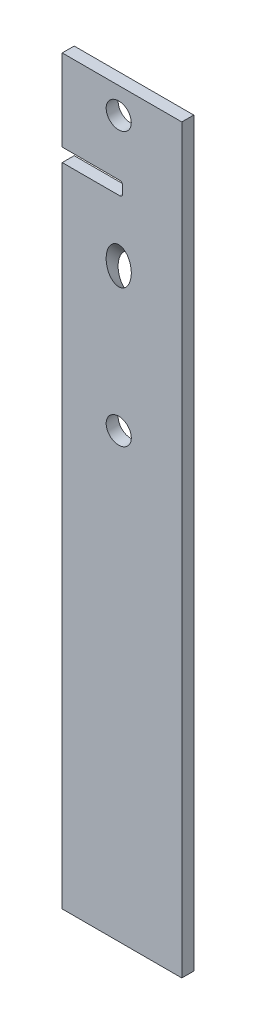
ISO-10303-21;
HEADER;
FILE_DESCRIPTION(('STEP AP214'),'2;1');
FILE_NAME('part.step','',(''),(''),'','','');
FILE_SCHEMA(('AUTOMOTIVE_DESIGN { 1 0 10303 214 1 1 1 1 }'));
ENDSEC;
DATA;
#1=APPLICATION_CONTEXT('core data for automotive mechanical design processes');
#2=APPLICATION_PROTOCOL_DEFINITION('international standard','automotive_design',2000,#1);
#3=PRODUCT_CONTEXT('',#1,'mechanical');
#4=PRODUCT('Part','Part','',(#3));
#5=PRODUCT_RELATED_PRODUCT_CATEGORY('part','',(#4));
#6=PRODUCT_DEFINITION_FORMATION('','',#4);
#7=PRODUCT_DEFINITION_CONTEXT('part definition',#1,'design');
#8=PRODUCT_DEFINITION('design','',#6,#7);
#9=PRODUCT_DEFINITION_SHAPE('','',#8);
#10=(LENGTH_UNIT() NAMED_UNIT(*) SI_UNIT(.MILLI.,.METRE.));
#11=(NAMED_UNIT(*) PLANE_ANGLE_UNIT() SI_UNIT($,.RADIAN.));
#12=(NAMED_UNIT(*) SI_UNIT($,.STERADIAN.) SOLID_ANGLE_UNIT());
#13=UNCERTAINTY_MEASURE_WITH_UNIT(LENGTH_MEASURE(1.E-05),#10,'distance_accuracy_value','');
#14=(GEOMETRIC_REPRESENTATION_CONTEXT(3) GLOBAL_UNCERTAINTY_ASSIGNED_CONTEXT((#13)) GLOBAL_UNIT_ASSIGNED_CONTEXT((#10,
#11,#12)) REPRESENTATION_CONTEXT('',''));
#15=CARTESIAN_POINT('',(0.,0.,0.));
#16=DIRECTION('',(0.,0.,1.));
#17=DIRECTION('',(1.,0.,0.));
#18=AXIS2_PLACEMENT_3D('',#15,#16,#17);
#19=CARTESIAN_POINT('',(2540.,317.5,-143.842086105115));
#20=DIRECTION('',(1.,0.,0.));
#21=DIRECTION('',(0.,0.,-1.));
#22=AXIS2_PLACEMENT_3D('',#19,#20,#21);
#23=PLANE('',#22);
#24=DIRECTION('',(0.,0.,1.));
#25=VECTOR('',#24,1.);
#26=CARTESIAN_POINT('',(2540.,216.638,-143.842086105115));
#27=LINE('',#26,#25);
#28=CARTESIAN_POINT('',(2540.,216.638,-143.842086105115));
#29=VERTEX_POINT('',#28);
#30=CARTESIAN_POINT('',(2540.,216.638,-131.142086105115));
#31=VERTEX_POINT('',#30);
#32=EDGE_CURVE('E167',#29,#31,#27,.T.);
#33=ORIENTED_EDGE('',*,*,#32,.F.);
#34=DIRECTION('',(0.,-1.,0.));
#35=VECTOR('',#34,1.);
#36=CARTESIAN_POINT('',(2540.,317.5,-143.842086105115));
#37=LINE('',#36,#35);
#38=CARTESIAN_POINT('',(2540.,-469.9,-143.842086105115));
#39=VERTEX_POINT('',#38);
#40=EDGE_CURVE('E248',#29,#39,#37,.T.);
#41=ORIENTED_EDGE('',*,*,#40,.T.);
#42=DIRECTION('',(0.,0.,1.));
#43=VECTOR('',#42,1.);
#44=CARTESIAN_POINT('',(2540.,-469.9,-143.842086105115));
#45=LINE('',#44,#43);
#46=CARTESIAN_POINT('',(2540.,-469.9,-131.142086105115));
#47=VERTEX_POINT('',#46);
#48=EDGE_CURVE('E165',#39,#47,#45,.T.);
#49=ORIENTED_EDGE('',*,*,#48,.T.);
#50=DIRECTION('',(0.,-1.,0.));
#51=VECTOR('',#50,1.);
#52=CARTESIAN_POINT('',(2540.,317.5,-131.142086105115));
#53=LINE('',#52,#51);
#54=EDGE_CURVE('E152',#31,#47,#53,.T.);
#55=ORIENTED_EDGE('',*,*,#54,.F.);
#56=EDGE_LOOP('',(#33,#41,#49,#55));
#57=FACE_BOUND('',#56,.T.);
#58=ADVANCED_FACE('F44',(#57),#23,.F.);
#59=CARTESIAN_POINT('',(2540.,317.5,-143.842086105115));
#60=VERTEX_POINT('',#59);
#61=CARTESIAN_POINT('',(2540.,230.862,-143.842086105115));
#62=VERTEX_POINT('',#61);
#63=EDGE_CURVE('E255',#60,#62,#37,.T.);
#64=ORIENTED_EDGE('',*,*,#63,.T.);
#65=DIRECTION('',(0.,0.,1.));
#66=VECTOR('',#65,1.);
#67=CARTESIAN_POINT('',(2540.,230.862,-143.842086105115));
#68=LINE('',#67,#66);
#69=CARTESIAN_POINT('',(2540.,230.862,-131.142086105115));
#70=VERTEX_POINT('',#69);
#71=EDGE_CURVE('E149',#62,#70,#68,.T.);
#72=ORIENTED_EDGE('',*,*,#71,.T.);
#73=CARTESIAN_POINT('',(2540.,317.5,-131.142086105115));
#74=VERTEX_POINT('',#73);
#75=EDGE_CURVE('E127',#74,#70,#53,.T.);
#76=ORIENTED_EDGE('',*,*,#75,.F.);
#77=DIRECTION('',(0.,0.,1.));
#78=VECTOR('',#77,1.);
#79=CARTESIAN_POINT('',(2540.,317.5,-143.842086105115));
#80=LINE('',#79,#78);
#81=EDGE_CURVE('E134',#60,#74,#80,.T.);
#82=ORIENTED_EDGE('',*,*,#81,.F.);
#83=EDGE_LOOP('',(#64,#72,#76,#82));
#84=FACE_BOUND('',#83,.T.);
#85=ADVANCED_FACE('F147',(#84),#23,.F.);
#86=CARTESIAN_POINT('',(2540.,317.5,-131.142086105115));
#87=DIRECTION('',(0.,0.,-1.));
#88=DIRECTION('',(-1.,0.,0.));
#89=AXIS2_PLACEMENT_3D('',#86,#87,#88);
#90=PLANE('',#89);
#91=CARTESIAN_POINT('',(2599.99999999996,289.999999999996,-131.142086105115));
#92=DIRECTION('',(0.,0.,-1.));
#93=DIRECTION('',(-1.,0.,0.));
#94=AXIS2_PLACEMENT_3D('',#91,#92,#93);
#95=CIRCLE('',#94,13.3349999999999);
#96=CARTESIAN_POINT('',(2586.66499999996,289.999999999996,-131.142086105115));
#97=VERTEX_POINT('',#96);
#98=EDGE_CURVE('E194',#97,#97,#95,.F.);
#99=ORIENTED_EDGE('',*,*,#98,.F.);
#100=EDGE_LOOP('',(#99));
#101=FACE_BOUND('',#100,.T.);
#102=ORIENTED_EDGE('',*,*,#75,.T.);
#103=DIRECTION('',(1.,0.,0.));
#104=VECTOR('',#103,1.);
#105=CARTESIAN_POINT('',(2540.,230.862,-131.142086105115));
#106=LINE('',#105,#104);
#107=CARTESIAN_POINT('',(2601.087,230.862,-131.142086105115));
#108=VERTEX_POINT('',#107);
#109=EDGE_CURVE('E166',#70,#108,#106,.T.);
#110=ORIENTED_EDGE('',*,*,#109,.T.);
#111=CARTESIAN_POINT('',(2601.087,227.687,-131.142086105115));
#112=DIRECTION('',(0.,0.,-1.));
#113=DIRECTION('',(-1.,0.,0.));
#114=AXIS2_PLACEMENT_3D('',#111,#112,#113);
#115=CIRCLE('',#114,3.175);
#116=CARTESIAN_POINT('',(2604.262,227.687,-131.142086105115));
#117=VERTEX_POINT('',#116);
#118=EDGE_CURVE('E228',#108,#117,#115,.T.);
#119=ORIENTED_EDGE('',*,*,#118,.T.);
#120=DIRECTION('',(0.,1.,0.));
#121=VECTOR('',#120,1.);
#122=CARTESIAN_POINT('',(2604.262,217.4,-131.142086105115));
#123=LINE('',#122,#121);
#124=CARTESIAN_POINT('',(2604.262,219.813,-131.142086105115));
#125=VERTEX_POINT('',#124);
#126=EDGE_CURVE('E179',#125,#117,#123,.T.);
#127=ORIENTED_EDGE('',*,*,#126,.F.);
#128=CARTESIAN_POINT('',(2601.087,219.813,-131.142086105115));
#129=DIRECTION('',(0.,0.,-1.));
#130=DIRECTION('',(-1.,0.,0.));
#131=AXIS2_PLACEMENT_3D('',#128,#129,#130);
#132=CIRCLE('',#131,3.175);
#133=CARTESIAN_POINT('',(2601.087,216.638,-131.142086105115));
#134=VERTEX_POINT('',#133);
#135=EDGE_CURVE('E12',#125,#134,#132,.T.);
#136=ORIENTED_EDGE('',*,*,#135,.T.);
#137=DIRECTION('',(1.,0.,0.));
#138=VECTOR('',#137,1.);
#139=CARTESIAN_POINT('',(2540.,216.638,-131.142086105115));
#140=LINE('',#139,#138);
#141=EDGE_CURVE('E162',#31,#134,#140,.T.);
#142=ORIENTED_EDGE('',*,*,#141,.F.);
#143=ORIENTED_EDGE('',*,*,#54,.T.);
#144=DIRECTION('',(1.,0.,0.));
#145=VECTOR('',#144,1.);
#146=CARTESIAN_POINT('',(2540.,-469.9,-131.142086105115));
#147=LINE('',#146,#145);
#148=CARTESIAN_POINT('',(2667.,-469.9,-131.142086105115));
#149=VERTEX_POINT('',#148);
#150=EDGE_CURVE('E158',#47,#149,#147,.T.);
#151=ORIENTED_EDGE('',*,*,#150,.T.);
#152=DIRECTION('',(0.,-1.,0.));
#153=VECTOR('',#152,1.);
#154=CARTESIAN_POINT('',(2667.,317.5,-131.142086105115));
#155=LINE('',#154,#153);
#156=CARTESIAN_POINT('',(2667.,317.5,-131.142086105115));
#157=VERTEX_POINT('',#156);
#158=EDGE_CURVE('E129',#157,#149,#155,.T.);
#159=ORIENTED_EDGE('',*,*,#158,.F.);
#160=DIRECTION('',(1.,0.,0.));
#161=VECTOR('',#160,1.);
#162=CARTESIAN_POINT('',(2540.,317.5,-131.142086105115));
#163=LINE('',#162,#161);
#164=EDGE_CURVE('E121',#74,#157,#163,.T.);
#165=ORIENTED_EDGE('',*,*,#164,.F.);
#166=EDGE_LOOP('',(#102,#110,#119,#127,#136,#142,#143,#151,#159,#165));
#167=FACE_BOUND('',#166,.T.);
#168=CARTESIAN_POINT('',(2599.99999999996,-1.09407005656713E-12,-131.142086105115));
#169=DIRECTION('',(0.,0.,-1.));
#170=DIRECTION('',(-1.,0.,0.));
#171=AXIS2_PLACEMENT_3D('',#168,#169,#170);
#172=CIRCLE('',#171,13.3349999999999);
#173=CARTESIAN_POINT('',(2586.66499999996,-1.09407005656713E-12,-131.142086105115));
#174=VERTEX_POINT('',#173);
#175=EDGE_CURVE('E202',#174,#174,#172,.F.);
#176=ORIENTED_EDGE('',*,*,#175,.F.);
#177=EDGE_LOOP('',(#176));
#178=FACE_BOUND('',#177,.T.);
#179=CARTESIAN_POINT('',(2599.99999999996,151.704709198241,-131.142086105115));
#180=DIRECTION('',(0.,0.,-1.));
#181=DIRECTION('',(0.,1.,0.));
#182=AXIS2_PLACEMENT_3D('',#179,#180,#181);
#183=ELLIPSE('',#182,19.379687717848,13.3349999999999);
#184=CARTESIAN_POINT('',(2599.99999999996,171.084396916089,-131.142086105115));
#185=VERTEX_POINT('',#184);
#186=EDGE_CURVE('E182',#185,#185,#183,.F.);
#187=ORIENTED_EDGE('',*,*,#186,.F.);
#188=EDGE_LOOP('',(#187));
#189=FACE_BOUND('',#188,.T.);
#190=ADVANCED_FACE('F123',(#101,#167,#178,#189),#90,.F.);
#191=CARTESIAN_POINT('',(2667.,317.5,-143.842086105115));
#192=DIRECTION('',(-1.,0.,0.));
#193=DIRECTION('',(0.,0.,1.));
#194=AXIS2_PLACEMENT_3D('',#191,#192,#193);
#195=PLANE('',#194);
#196=DIRECTION('',(0.,0.,-1.));
#197=VECTOR('',#196,1.);
#198=CARTESIAN_POINT('',(2667.,-469.9,-143.842086105115));
#199=LINE('',#198,#197);
#200=CARTESIAN_POINT('',(2667.,-469.9,-143.842086105115));
#201=VERTEX_POINT('',#200);
#202=EDGE_CURVE('E151',#149,#201,#199,.T.);
#203=ORIENTED_EDGE('',*,*,#202,.T.);
#204=DIRECTION('',(0.,-1.,0.));
#205=VECTOR('',#204,1.);
#206=CARTESIAN_POINT('',(2667.,317.5,-143.842086105115));
#207=LINE('',#206,#205);
#208=CARTESIAN_POINT('',(2667.,317.5,-143.842086105115));
#209=VERTEX_POINT('',#208);
#210=EDGE_CURVE('E144',#209,#201,#207,.T.);
#211=ORIENTED_EDGE('',*,*,#210,.F.);
#212=DIRECTION('',(0.,0.,-1.));
#213=VECTOR('',#212,1.);
#214=CARTESIAN_POINT('',(2667.,317.5,-143.842086105115));
#215=LINE('',#214,#213);
#216=EDGE_CURVE('E133',#157,#209,#215,.T.);
#217=ORIENTED_EDGE('',*,*,#216,.F.);
#218=ORIENTED_EDGE('',*,*,#158,.T.);
#219=EDGE_LOOP('',(#203,#211,#217,#218));
#220=FACE_BOUND('',#219,.T.);
#221=ADVANCED_FACE('F269',(#220),#195,.F.);
#222=CARTESIAN_POINT('',(2540.,317.5,-143.842086105115));
#223=DIRECTION('',(0.,0.,1.));
#224=DIRECTION('',(1.,0.,0.));
#225=AXIS2_PLACEMENT_3D('',#222,#223,#224);
#226=PLANE('',#225);
#227=CARTESIAN_POINT('',(2599.99999999996,289.999999999996,-143.842086105115));
#228=DIRECTION('',(0.,0.,1.));
#229=DIRECTION('',(1.,0.,0.));
#230=AXIS2_PLACEMENT_3D('',#227,#228,#229);
#231=CIRCLE('',#230,13.3349999999999);
#232=CARTESIAN_POINT('',(2613.33499999996,289.999999999996,-143.842086105115));
#233=VERTEX_POINT('',#232);
#234=EDGE_CURVE('E198',#233,#233,#231,.F.);
#235=ORIENTED_EDGE('',*,*,#234,.F.);
#236=EDGE_LOOP('',(#235));
#237=FACE_BOUND('',#236,.T.);
#238=ORIENTED_EDGE('',*,*,#210,.T.);
#239=DIRECTION('',(-1.,0.,0.));
#240=VECTOR('',#239,1.);
#241=CARTESIAN_POINT('',(2540.,-469.9,-143.842086105115));
#242=LINE('',#241,#240);
#243=EDGE_CURVE('E262',#201,#39,#242,.T.);
#244=ORIENTED_EDGE('',*,*,#243,.T.);
#245=ORIENTED_EDGE('',*,*,#40,.F.);
#246=DIRECTION('',(-1.,0.,0.));
#247=VECTOR('',#246,1.);
#248=CARTESIAN_POINT('',(2540.,216.638,-143.842086105115));
#249=LINE('',#248,#247);
#250=CARTESIAN_POINT('',(2601.087,216.638,-143.842086105115));
#251=VERTEX_POINT('',#250);
#252=EDGE_CURVE('E171',#251,#29,#249,.T.);
#253=ORIENTED_EDGE('',*,*,#252,.F.);
#254=CARTESIAN_POINT('',(2601.087,219.813,-143.842086105115));
#255=DIRECTION('',(0.,0.,1.));
#256=DIRECTION('',(1.,0.,0.));
#257=AXIS2_PLACEMENT_3D('',#254,#255,#256);
#258=CIRCLE('',#257,3.175);
#259=CARTESIAN_POINT('',(2604.262,219.813,-143.842086105115));
#260=VERTEX_POINT('',#259);
#261=EDGE_CURVE('E53',#251,#260,#258,.T.);
#262=ORIENTED_EDGE('',*,*,#261,.T.);
#263=DIRECTION('',(0.,1.,0.));
#264=VECTOR('',#263,1.);
#265=CARTESIAN_POINT('',(2604.262,317.5,-143.842086105115));
#266=LINE('',#265,#264);
#267=CARTESIAN_POINT('',(2604.262,227.687,-143.842086105115));
#268=VERTEX_POINT('',#267);
#269=EDGE_CURVE('E170',#260,#268,#266,.T.);
#270=ORIENTED_EDGE('',*,*,#269,.T.);
#271=CARTESIAN_POINT('',(2601.087,227.687,-143.842086105115));
#272=DIRECTION('',(0.,0.,1.));
#273=DIRECTION('',(1.,0.,0.));
#274=AXIS2_PLACEMENT_3D('',#271,#272,#273);
#275=CIRCLE('',#274,3.175);
#276=CARTESIAN_POINT('',(2601.087,230.862,-143.842086105115));
#277=VERTEX_POINT('',#276);
#278=EDGE_CURVE('E225',#268,#277,#275,.T.);
#279=ORIENTED_EDGE('',*,*,#278,.T.);
#280=DIRECTION('',(-1.,0.,0.));
#281=VECTOR('',#280,1.);
#282=CARTESIAN_POINT('',(2540.,230.862,-143.842086105115));
#283=LINE('',#282,#281);
#284=EDGE_CURVE('E175',#277,#62,#283,.T.);
#285=ORIENTED_EDGE('',*,*,#284,.T.);
#286=ORIENTED_EDGE('',*,*,#63,.F.);
#287=DIRECTION('',(-1.,0.,0.));
#288=VECTOR('',#287,1.);
#289=CARTESIAN_POINT('',(2540.,317.5,-143.842086105115));
#290=LINE('',#289,#288);
#291=EDGE_CURVE('E139',#209,#60,#290,.T.);
#292=ORIENTED_EDGE('',*,*,#291,.F.);
#293=EDGE_LOOP('',(#238,#244,#245,#253,#262,#270,#279,#285,#286,#292));
#294=FACE_BOUND('',#293,.T.);
#295=CARTESIAN_POINT('',(2599.99999999996,138.311981925514,-143.842086105115));
#296=DIRECTION('',(0.,0.,1.));
#297=DIRECTION('',(0.,1.,0.));
#298=AXIS2_PLACEMENT_3D('',#295,#296,#297);
#299=ELLIPSE('',#298,19.379687717848,13.3349999999999);
#300=CARTESIAN_POINT('',(2599.99999999996,157.691669643362,-143.842086105115));
#301=VERTEX_POINT('',#300);
#302=EDGE_CURVE('E190',#301,#301,#299,.F.);
#303=ORIENTED_EDGE('',*,*,#302,.F.);
#304=EDGE_LOOP('',(#303));
#305=FACE_BOUND('',#304,.T.);
#306=CARTESIAN_POINT('',(2599.99999999996,-9.97483853262698E-13,-143.842086105115));
#307=DIRECTION('',(0.,0.,1.));
#308=DIRECTION('',(1.,0.,0.));
#309=AXIS2_PLACEMENT_3D('',#306,#307,#308);
#310=CIRCLE('',#309,13.3349999999999);
#311=CARTESIAN_POINT('',(2613.33499999996,-9.97483853262698E-13,-143.842086105115));
#312=VERTEX_POINT('',#311);
#313=EDGE_CURVE('E206',#312,#312,#310,.F.);
#314=ORIENTED_EDGE('',*,*,#313,.F.);
#315=EDGE_LOOP('',(#314));
#316=FACE_BOUND('',#315,.T.);
#317=ADVANCED_FACE('F234',(#237,#294,#305,#316),#226,.F.);
#318=CARTESIAN_POINT('',(0.,317.5,0.));
#319=DIRECTION('',(0.,1.,0.));
#320=DIRECTION('',(0.,0.,1.));
#321=AXIS2_PLACEMENT_3D('',#318,#319,#320);
#322=PLANE('',#321);
#323=ORIENTED_EDGE('',*,*,#81,.T.);
#324=ORIENTED_EDGE('',*,*,#164,.T.);
#325=ORIENTED_EDGE('',*,*,#216,.T.);
#326=ORIENTED_EDGE('',*,*,#291,.T.);
#327=EDGE_LOOP('',(#323,#324,#325,#326));
#328=FACE_BOUND('',#327,.T.);
#329=ADVANCED_FACE('F137',(#328),#322,.T.);
#330=CARTESIAN_POINT('',(0.,-469.9,0.));
#331=DIRECTION('',(0.,1.,0.));
#332=DIRECTION('',(0.,0.,1.));
#333=AXIS2_PLACEMENT_3D('',#330,#331,#332);
#334=PLANE('',#333);
#335=ORIENTED_EDGE('',*,*,#48,.F.);
#336=ORIENTED_EDGE('',*,*,#243,.F.);
#337=ORIENTED_EDGE('',*,*,#202,.F.);
#338=ORIENTED_EDGE('',*,*,#150,.F.);
#339=EDGE_LOOP('',(#335,#336,#337,#338));
#340=FACE_BOUND('',#339,.T.);
#341=ADVANCED_FACE('F270',(#340),#334,.F.);
#342=CARTESIAN_POINT('',(2599.99999999996,0.,-275.000000000001));
#343=DIRECTION('',(0.,0.,1.));
#344=DIRECTION('',(0.,-1.,0.));
#345=AXIS2_PLACEMENT_3D('',#342,#343,#344);
#346=CYLINDRICAL_SURFACE('',#345,13.3349999999999);
#347=ORIENTED_EDGE('',*,*,#313,.T.);
#348=EDGE_LOOP('',(#347));
#349=FACE_BOUND('',#348,.T.);
#350=ORIENTED_EDGE('',*,*,#175,.T.);
#351=EDGE_LOOP('',(#350));
#352=FACE_BOUND('',#351,.T.);
#353=ADVANCED_FACE('F272',(#349,#352),#346,.F.);
#354=CARTESIAN_POINT('',(2599.99999999996,289.999999999996,275.));
#355=DIRECTION('',(0.,0.,-1.));
#356=DIRECTION('',(0.,1.,0.));
#357=AXIS2_PLACEMENT_3D('',#354,#355,#356);
#358=CYLINDRICAL_SURFACE('',#357,13.3349999999999);
#359=ORIENTED_EDGE('',*,*,#234,.T.);
#360=EDGE_LOOP('',(#359));
#361=FACE_BOUND('',#360,.T.);
#362=ORIENTED_EDGE('',*,*,#98,.T.);
#363=EDGE_LOOP('',(#362));
#364=FACE_BOUND('',#363,.T.);
#365=ADVANCED_FACE('F278',(#361,#364),#358,.F.);
#366=CARTESIAN_POINT('',(2599.99999999996,0.,-275.000000000001));
#367=DIRECTION('',(0.,0.725623851173429,0.688091583009297));
#368=DIRECTION('',(0.,-0.688091583009297,0.725623851173429));
#369=AXIS2_PLACEMENT_3D('',#366,#367,#368);
#370=CYLINDRICAL_SURFACE('',#369,13.3349999999999);
#371=ORIENTED_EDGE('',*,*,#302,.T.);
#372=EDGE_LOOP('',(#371));
#373=FACE_BOUND('',#372,.T.);
#374=ORIENTED_EDGE('',*,*,#186,.T.);
#375=EDGE_LOOP('',(#374));
#376=FACE_BOUND('',#375,.T.);
#377=ADVANCED_FACE('F298',(#373,#376),#370,.F.);
#378=CARTESIAN_POINT('',(0.,216.638,0.));
#379=DIRECTION('',(0.,1.,0.));
#380=DIRECTION('',(0.,0.,1.));
#381=AXIS2_PLACEMENT_3D('',#378,#379,#380);
#382=PLANE('',#381);
#383=ORIENTED_EDGE('',*,*,#141,.T.);
#384=DIRECTION('',(0.,0.,-1.));
#385=VECTOR('',#384,1.);
#386=CARTESIAN_POINT('',(2601.08699999999,216.638,9.09539110693912E-11));
#387=LINE('',#386,#385);
#388=EDGE_CURVE('E222',#134,#251,#387,.T.);
#389=ORIENTED_EDGE('',*,*,#388,.T.);
#390=ORIENTED_EDGE('',*,*,#252,.T.);
#391=ORIENTED_EDGE('',*,*,#32,.T.);
#392=EDGE_LOOP('',(#383,#389,#390,#391));
#393=FACE_BOUND('',#392,.T.);
#394=ADVANCED_FACE('F241',(#393),#382,.T.);
#395=CARTESIAN_POINT('',(0.,230.862,0.));
#396=DIRECTION('',(0.,1.,0.));
#397=DIRECTION('',(0.,0.,1.));
#398=AXIS2_PLACEMENT_3D('',#395,#396,#397);
#399=PLANE('',#398);
#400=ORIENTED_EDGE('',*,*,#284,.F.);
#401=DIRECTION('',(0.,0.,-1.));
#402=VECTOR('',#401,1.);
#403=CARTESIAN_POINT('',(2601.087,230.862,-131.142086105115));
#404=LINE('',#403,#402);
#405=EDGE_CURVE('E219',#277,#108,#404,.F.);
#406=ORIENTED_EDGE('',*,*,#405,.T.);
#407=ORIENTED_EDGE('',*,*,#109,.F.);
#408=ORIENTED_EDGE('',*,*,#71,.F.);
#409=EDGE_LOOP('',(#400,#406,#407,#408));
#410=FACE_BOUND('',#409,.T.);
#411=ADVANCED_FACE('F297',(#410),#399,.F.);
#412=CARTESIAN_POINT('',(2604.262,217.4,-131.142086105114));
#413=DIRECTION('',(1.,0.,0.));
#414=DIRECTION('',(0.,0.,-1.));
#415=AXIS2_PLACEMENT_3D('',#412,#413,#414);
#416=PLANE('',#415);
#417=ORIENTED_EDGE('',*,*,#126,.T.);
#418=DIRECTION('',(0.,0.,-1.));
#419=VECTOR('',#418,1.);
#420=CARTESIAN_POINT('',(2604.262,227.687,-143.842086105115));
#421=LINE('',#420,#419);
#422=EDGE_CURVE('E215',#117,#268,#421,.T.);
#423=ORIENTED_EDGE('',*,*,#422,.T.);
#424=ORIENTED_EDGE('',*,*,#269,.F.);
#425=DIRECTION('',(0.,0.,-1.));
#426=VECTOR('',#425,1.);
#427=CARTESIAN_POINT('',(2604.262,219.813,-131.142086105114));
#428=LINE('',#427,#426);
#429=EDGE_CURVE('E174',#260,#125,#428,.F.);
#430=ORIENTED_EDGE('',*,*,#429,.T.);
#431=EDGE_LOOP('',(#417,#423,#424,#430));
#432=FACE_BOUND('',#431,.T.);
#433=ADVANCED_FACE('F238',(#432),#416,.F.);
#434=CARTESIAN_POINT('',(2601.087,227.687,-131.142086105115));
#435=DIRECTION('',(0.,0.,1.));
#436=DIRECTION('',(1.,0.,0.));
#437=AXIS2_PLACEMENT_3D('',#434,#435,#436);
#438=CYLINDRICAL_SURFACE('',#437,3.175);
#439=ORIENTED_EDGE('',*,*,#118,.F.);
#440=ORIENTED_EDGE('',*,*,#405,.F.);
#441=ORIENTED_EDGE('',*,*,#278,.F.);
#442=ORIENTED_EDGE('',*,*,#422,.F.);
#443=EDGE_LOOP('',(#439,#440,#441,#442));
#444=FACE_BOUND('',#443,.T.);
#445=ADVANCED_FACE('F301',(#444),#438,.F.);
#446=CARTESIAN_POINT('',(2601.08699999999,219.813,9.09539110693912E-11));
#447=DIRECTION('',(0.,0.,-1.));
#448=DIRECTION('',(-1.,0.,0.));
#449=AXIS2_PLACEMENT_3D('',#446,#447,#448);
#450=CYLINDRICAL_SURFACE('',#449,3.175);
#451=ORIENTED_EDGE('',*,*,#135,.F.);
#452=ORIENTED_EDGE('',*,*,#429,.F.);
#453=ORIENTED_EDGE('',*,*,#261,.F.);
#454=ORIENTED_EDGE('',*,*,#388,.F.);
#455=EDGE_LOOP('',(#451,#452,#453,#454));
#456=FACE_BOUND('',#455,.T.);
#457=ADVANCED_FACE('F46',(#456),#450,.F.);
#458=CLOSED_SHELL('',(#58,#85,#190,#221,#317,#329,#341,#353,#365,#377,#394,#411,#433,#445,#457));
#459=MANIFOLD_SOLID_BREP('B2',#458);
#460=ADVANCED_BREP_SHAPE_REPRESENTATION('',(#18,#459),#14);
#461=SHAPE_DEFINITION_REPRESENTATION(#9,#460);
ENDSEC;
END-ISO-10303-21;
